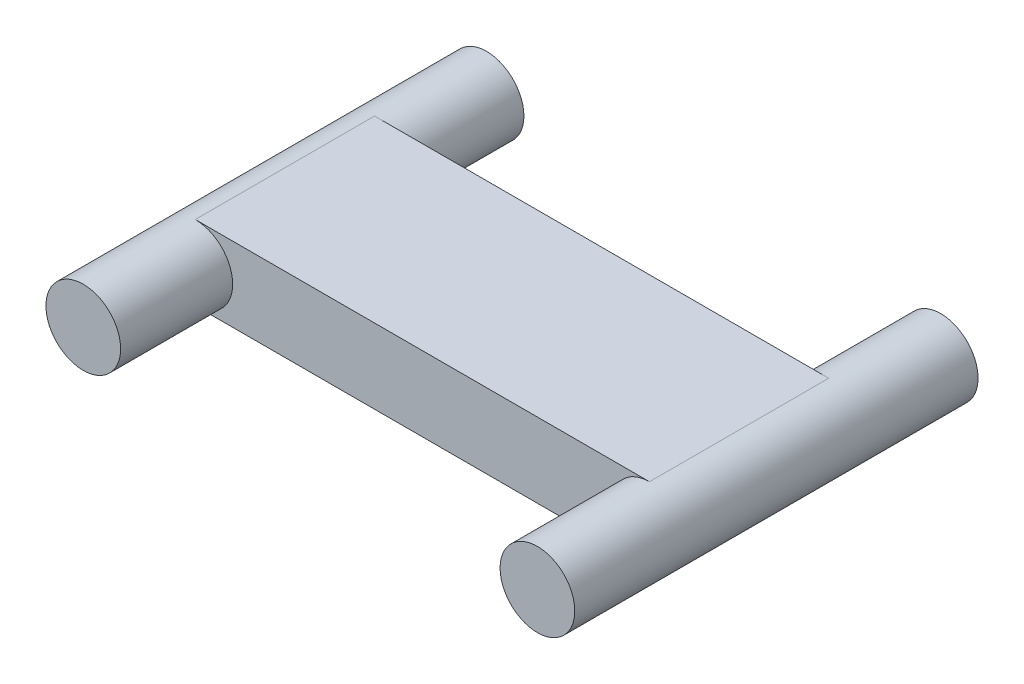
ISO-10303-21;
HEADER;
FILE_DESCRIPTION(('STEP AP214'),'2;1');
FILE_NAME('part.step','',(''),(''),'','','');
FILE_SCHEMA(('AUTOMOTIVE_DESIGN { 1 0 10303 214 1 1 1 1 }'));
ENDSEC;
DATA;
#1=APPLICATION_CONTEXT('core data for automotive mechanical design processes');
#2=APPLICATION_PROTOCOL_DEFINITION('international standard','automotive_design',2000,#1);
#3=PRODUCT_CONTEXT('',#1,'mechanical');
#4=PRODUCT('Part','Part','',(#3));
#5=PRODUCT_RELATED_PRODUCT_CATEGORY('part','',(#4));
#6=PRODUCT_DEFINITION_FORMATION('','',#4);
#7=PRODUCT_DEFINITION_CONTEXT('part definition',#1,'design');
#8=PRODUCT_DEFINITION('design','',#6,#7);
#9=PRODUCT_DEFINITION_SHAPE('','',#8);
#10=(LENGTH_UNIT() NAMED_UNIT(*) SI_UNIT(.MILLI.,.METRE.));
#11=(NAMED_UNIT(*) PLANE_ANGLE_UNIT() SI_UNIT($,.RADIAN.));
#12=(NAMED_UNIT(*) SI_UNIT($,.STERADIAN.) SOLID_ANGLE_UNIT());
#13=UNCERTAINTY_MEASURE_WITH_UNIT(LENGTH_MEASURE(1.E-05),#10,'distance_accuracy_value','');
#14=(GEOMETRIC_REPRESENTATION_CONTEXT(3) GLOBAL_UNCERTAINTY_ASSIGNED_CONTEXT((#13)) GLOBAL_UNIT_ASSIGNED_CONTEXT((#10,
#11,#12)) REPRESENTATION_CONTEXT('',''));
#15=CARTESIAN_POINT('',(0.,0.,0.));
#16=DIRECTION('',(0.,0.,1.));
#17=DIRECTION('',(1.,0.,0.));
#18=AXIS2_PLACEMENT_3D('',#15,#16,#17);
#19=CARTESIAN_POINT('',(-9.65327,0.,3.81));
#20=DIRECTION('',(0.,0.,-1.));
#21=DIRECTION('',(-1.,0.,0.));
#22=AXIS2_PLACEMENT_3D('',#19,#20,#21);
#23=CYLINDRICAL_SURFACE('',#22,1.5875);
#24=DIRECTION('',(0.,0.,-1.));
#25=VECTOR('',#24,1.);
#26=CARTESIAN_POINT('',(-9.65327,1.5875,3.81));
#27=LINE('',#26,#25);
#28=CARTESIAN_POINT('',(-9.65327,1.5875,3.81));
#29=VERTEX_POINT('',#28);
#30=CARTESIAN_POINT('',(-9.65327,1.5875,-3.81));
#31=VERTEX_POINT('',#30);
#32=EDGE_CURVE('E66',#29,#31,#27,.T.);
#33=ORIENTED_EDGE('',*,*,#32,.T.);
#34=CARTESIAN_POINT('',(-9.65327,0.,-3.81));
#35=DIRECTION('',(0.,0.,1.));
#36=DIRECTION('',(1.,0.,0.));
#37=AXIS2_PLACEMENT_3D('',#34,#35,#36);
#38=CIRCLE('',#37,1.5875);
#39=CARTESIAN_POINT('',(-9.65327,-1.5875,-3.81));
#40=VERTEX_POINT('',#39);
#41=EDGE_CURVE('E11',#40,#31,#38,.T.);
#42=ORIENTED_EDGE('',*,*,#41,.F.);
#43=DIRECTION('',(0.,0.,-1.));
#44=VECTOR('',#43,1.);
#45=CARTESIAN_POINT('',(-9.65327,-1.5875,3.81));
#46=LINE('',#45,#44);
#47=CARTESIAN_POINT('',(-9.65327,-1.5875,3.81));
#48=VERTEX_POINT('',#47);
#49=EDGE_CURVE('E79',#48,#40,#46,.T.);
#50=ORIENTED_EDGE('',*,*,#49,.F.);
#51=CARTESIAN_POINT('',(-9.65327,0.,3.81));
#52=DIRECTION('',(0.,0.,1.));
#53=DIRECTION('',(1.,0.,0.));
#54=AXIS2_PLACEMENT_3D('',#51,#52,#53);
#55=CIRCLE('',#54,1.5875);
#56=EDGE_CURVE('E88',#48,#29,#55,.T.);
#57=ORIENTED_EDGE('',*,*,#56,.T.);
#58=EDGE_LOOP('',(#33,#42,#50,#57));
#59=FACE_BOUND('',#58,.T.);
#60=CARTESIAN_POINT('',(-9.65327,0.,8.5725));
#61=DIRECTION('',(0.,0.,1.));
#62=DIRECTION('',(1.,0.,0.));
#63=AXIS2_PLACEMENT_3D('',#60,#61,#62);
#64=CIRCLE('',#63,1.5875);
#65=CARTESIAN_POINT('',(-8.06577,0.,8.5725));
#66=VERTEX_POINT('',#65);
#67=EDGE_CURVE('E85',#66,#66,#64,.T.);
#68=ORIENTED_EDGE('',*,*,#67,.F.);
#69=EDGE_LOOP('',(#68));
#70=FACE_BOUND('',#69,.T.);
#71=CARTESIAN_POINT('',(-9.65327,0.,-8.5725));
#72=DIRECTION('',(0.,0.,1.));
#73=DIRECTION('',(1.,0.,0.));
#74=AXIS2_PLACEMENT_3D('',#71,#72,#73);
#75=CIRCLE('',#74,1.5875);
#76=CARTESIAN_POINT('',(-8.06577,0.,-8.5725));
#77=VERTEX_POINT('',#76);
#78=EDGE_CURVE('E209',#77,#77,#75,.T.);
#79=ORIENTED_EDGE('',*,*,#78,.T.);
#80=EDGE_LOOP('',(#79));
#81=FACE_BOUND('',#80,.T.);
#82=ADVANCED_FACE('F32',(#59,#70,#81),#23,.T.);
#83=CARTESIAN_POINT('',(9.65327,-1.5875,3.81));
#84=DIRECTION('',(0.,1.,0.));
#85=DIRECTION('',(-1.,0.,0.));
#86=AXIS2_PLACEMENT_3D('',#83,#84,#85);
#87=PLANE('',#86);
#88=DIRECTION('',(1.,0.,0.));
#89=VECTOR('',#88,1.);
#90=CARTESIAN_POINT('',(9.65327,-1.5875,-3.81));
#91=LINE('',#90,#89);
#92=CARTESIAN_POINT('',(9.65327,-1.5875,-3.81));
#93=VERTEX_POINT('',#92);
#94=EDGE_CURVE('E80',#40,#93,#91,.T.);
#95=ORIENTED_EDGE('',*,*,#94,.T.);
#96=DIRECTION('',(0.,0.,-1.));
#97=VECTOR('',#96,1.);
#98=CARTESIAN_POINT('',(9.65327,-1.5875,3.81));
#99=LINE('',#98,#97);
#100=CARTESIAN_POINT('',(9.65327,-1.5875,3.81));
#101=VERTEX_POINT('',#100);
#102=EDGE_CURVE('E89',#101,#93,#99,.T.);
#103=ORIENTED_EDGE('',*,*,#102,.F.);
#104=DIRECTION('',(1.,0.,0.));
#105=VECTOR('',#104,1.);
#106=CARTESIAN_POINT('',(9.65327,-1.5875,3.81));
#107=LINE('',#106,#105);
#108=EDGE_CURVE('E48',#48,#101,#107,.T.);
#109=ORIENTED_EDGE('',*,*,#108,.F.);
#110=ORIENTED_EDGE('',*,*,#49,.T.);
#111=EDGE_LOOP('',(#95,#103,#109,#110));
#112=FACE_BOUND('',#111,.T.);
#113=ADVANCED_FACE('F87',(#112),#87,.F.);
#114=CARTESIAN_POINT('',(9.65327,0.,3.81));
#115=DIRECTION('',(0.,0.,-1.));
#116=DIRECTION('',(-1.,0.,0.));
#117=AXIS2_PLACEMENT_3D('',#114,#115,#116);
#118=CYLINDRICAL_SURFACE('',#117,1.5875);
#119=ORIENTED_EDGE('',*,*,#102,.T.);
#120=CARTESIAN_POINT('',(9.65327,0.,-3.81));
#121=DIRECTION('',(0.,0.,-1.));
#122=DIRECTION('',(-1.,0.,0.));
#123=AXIS2_PLACEMENT_3D('',#120,#121,#122);
#124=CIRCLE('',#123,1.5875);
#125=CARTESIAN_POINT('',(9.65327,1.5875,-3.81));
#126=VERTEX_POINT('',#125);
#127=EDGE_CURVE('E40',#93,#126,#124,.T.);
#128=ORIENTED_EDGE('',*,*,#127,.T.);
#129=DIRECTION('',(0.,0.,-1.));
#130=VECTOR('',#129,1.);
#131=CARTESIAN_POINT('',(9.65327,1.5875,3.81));
#132=LINE('',#131,#130);
#133=CARTESIAN_POINT('',(9.65327,1.5875,3.81));
#134=VERTEX_POINT('',#133);
#135=EDGE_CURVE('E93',#134,#126,#132,.T.);
#136=ORIENTED_EDGE('',*,*,#135,.F.);
#137=CARTESIAN_POINT('',(9.65327,0.,3.81));
#138=DIRECTION('',(0.,0.,1.));
#139=DIRECTION('',(1.,0.,0.));
#140=AXIS2_PLACEMENT_3D('',#137,#138,#139);
#141=CIRCLE('',#140,1.5875);
#142=EDGE_CURVE('E91',#134,#101,#141,.T.);
#143=ORIENTED_EDGE('',*,*,#142,.T.);
#144=EDGE_LOOP('',(#119,#128,#136,#143));
#145=FACE_BOUND('',#144,.T.);
#146=CARTESIAN_POINT('',(9.65327,0.,8.5725));
#147=DIRECTION('',(0.,0.,-1.));
#148=DIRECTION('',(-1.,0.,0.));
#149=AXIS2_PLACEMENT_3D('',#146,#147,#148);
#150=CIRCLE('',#149,1.5875);
#151=CARTESIAN_POINT('',(8.06577,0.,8.5725));
#152=VERTEX_POINT('',#151);
#153=EDGE_CURVE('E202',#152,#152,#150,.T.);
#154=ORIENTED_EDGE('',*,*,#153,.T.);
#155=EDGE_LOOP('',(#154));
#156=FACE_BOUND('',#155,.T.);
#157=CARTESIAN_POINT('',(9.65327,0.,-8.5725));
#158=DIRECTION('',(0.,0.,-1.));
#159=DIRECTION('',(-1.,0.,0.));
#160=AXIS2_PLACEMENT_3D('',#157,#158,#159);
#161=CIRCLE('',#160,1.5875);
#162=CARTESIAN_POINT('',(8.06577,0.,-8.5725));
#163=VERTEX_POINT('',#162);
#164=EDGE_CURVE('E204',#163,#163,#161,.T.);
#165=ORIENTED_EDGE('',*,*,#164,.F.);
#166=EDGE_LOOP('',(#165));
#167=FACE_BOUND('',#166,.T.);
#168=ADVANCED_FACE('F129',(#145,#156,#167),#118,.T.);
#169=CARTESIAN_POINT('',(9.65327,1.5875,3.81));
#170=DIRECTION('',(0.,-1.,0.));
#171=DIRECTION('',(1.,0.,0.));
#172=AXIS2_PLACEMENT_3D('',#169,#170,#171);
#173=PLANE('',#172);
#174=DIRECTION('',(-1.,0.,0.));
#175=VECTOR('',#174,1.);
#176=CARTESIAN_POINT('',(9.65327,1.5875,-3.81));
#177=LINE('',#176,#175);
#178=EDGE_CURVE('E84',#126,#31,#177,.T.);
#179=ORIENTED_EDGE('',*,*,#178,.T.);
#180=ORIENTED_EDGE('',*,*,#32,.F.);
#181=DIRECTION('',(-1.,0.,0.));
#182=VECTOR('',#181,1.);
#183=CARTESIAN_POINT('',(9.65327,1.5875,3.81));
#184=LINE('',#183,#182);
#185=EDGE_CURVE('E116',#134,#29,#184,.T.);
#186=ORIENTED_EDGE('',*,*,#185,.F.);
#187=ORIENTED_EDGE('',*,*,#135,.T.);
#188=EDGE_LOOP('',(#179,#180,#186,#187));
#189=FACE_BOUND('',#188,.T.);
#190=ADVANCED_FACE('F126',(#189),#173,.F.);
#191=CARTESIAN_POINT('',(-9.65327,0.,3.81));
#192=DIRECTION('',(0.,0.,1.));
#193=DIRECTION('',(1.,0.,0.));
#194=AXIS2_PLACEMENT_3D('',#191,#192,#193);
#195=PLANE('',#194);
#196=ORIENTED_EDGE('',*,*,#142,.F.);
#197=ORIENTED_EDGE('',*,*,#185,.T.);
#198=ORIENTED_EDGE('',*,*,#56,.F.);
#199=ORIENTED_EDGE('',*,*,#108,.T.);
#200=EDGE_LOOP('',(#196,#197,#198,#199));
#201=FACE_BOUND('',#200,.T.);
#202=ADVANCED_FACE('F128',(#201),#195,.T.);
#203=CARTESIAN_POINT('',(-9.65327,0.,-3.81));
#204=DIRECTION('',(0.,0.,1.));
#205=DIRECTION('',(1.,0.,0.));
#206=AXIS2_PLACEMENT_3D('',#203,#204,#205);
#207=PLANE('',#206);
#208=ORIENTED_EDGE('',*,*,#94,.F.);
#209=ORIENTED_EDGE('',*,*,#41,.T.);
#210=ORIENTED_EDGE('',*,*,#178,.F.);
#211=ORIENTED_EDGE('',*,*,#127,.F.);
#212=EDGE_LOOP('',(#208,#209,#210,#211));
#213=FACE_BOUND('',#212,.T.);
#214=ADVANCED_FACE('F81',(#213),#207,.F.);
#215=CARTESIAN_POINT('',(-9.65327,0.,8.5725));
#216=DIRECTION('',(0.,0.,1.));
#217=DIRECTION('',(1.,0.,0.));
#218=AXIS2_PLACEMENT_3D('',#215,#216,#217);
#219=PLANE('',#218);
#220=ORIENTED_EDGE('',*,*,#67,.T.);
#221=EDGE_LOOP('',(#220));
#222=FACE_BOUND('',#221,.T.);
#223=ADVANCED_FACE('F167',(#222),#219,.T.);
#224=CARTESIAN_POINT('',(9.65327,0.,8.5725));
#225=DIRECTION('',(0.,0.,1.));
#226=DIRECTION('',(-1.,0.,0.));
#227=AXIS2_PLACEMENT_3D('',#224,#225,#226);
#228=PLANE('',#227);
#229=ORIENTED_EDGE('',*,*,#153,.F.);
#230=EDGE_LOOP('',(#229));
#231=FACE_BOUND('',#230,.T.);
#232=ADVANCED_FACE('F178',(#231),#228,.T.);
#233=CARTESIAN_POINT('',(9.65327,0.,-8.5725));
#234=DIRECTION('',(0.,0.,-1.));
#235=DIRECTION('',(-1.,0.,0.));
#236=AXIS2_PLACEMENT_3D('',#233,#234,#235);
#237=PLANE('',#236);
#238=ORIENTED_EDGE('',*,*,#164,.T.);
#239=EDGE_LOOP('',(#238));
#240=FACE_BOUND('',#239,.T.);
#241=ADVANCED_FACE('F173',(#240),#237,.T.);
#242=CARTESIAN_POINT('',(-9.65327,0.,-8.5725));
#243=DIRECTION('',(0.,0.,-1.));
#244=DIRECTION('',(1.,0.,0.));
#245=AXIS2_PLACEMENT_3D('',#242,#243,#244);
#246=PLANE('',#245);
#247=ORIENTED_EDGE('',*,*,#78,.F.);
#248=EDGE_LOOP('',(#247));
#249=FACE_BOUND('',#248,.T.);
#250=ADVANCED_FACE('F177',(#249),#246,.T.);
#251=CLOSED_SHELL('',(#82,#113,#168,#190,#202,#214,#223,#232,#241,#250));
#252=MANIFOLD_SOLID_BREP('B2',#251);
#253=ADVANCED_BREP_SHAPE_REPRESENTATION('',(#18,#252),#14);
#254=SHAPE_DEFINITION_REPRESENTATION(#9,#253);
ENDSEC;
END-ISO-10303-21;
